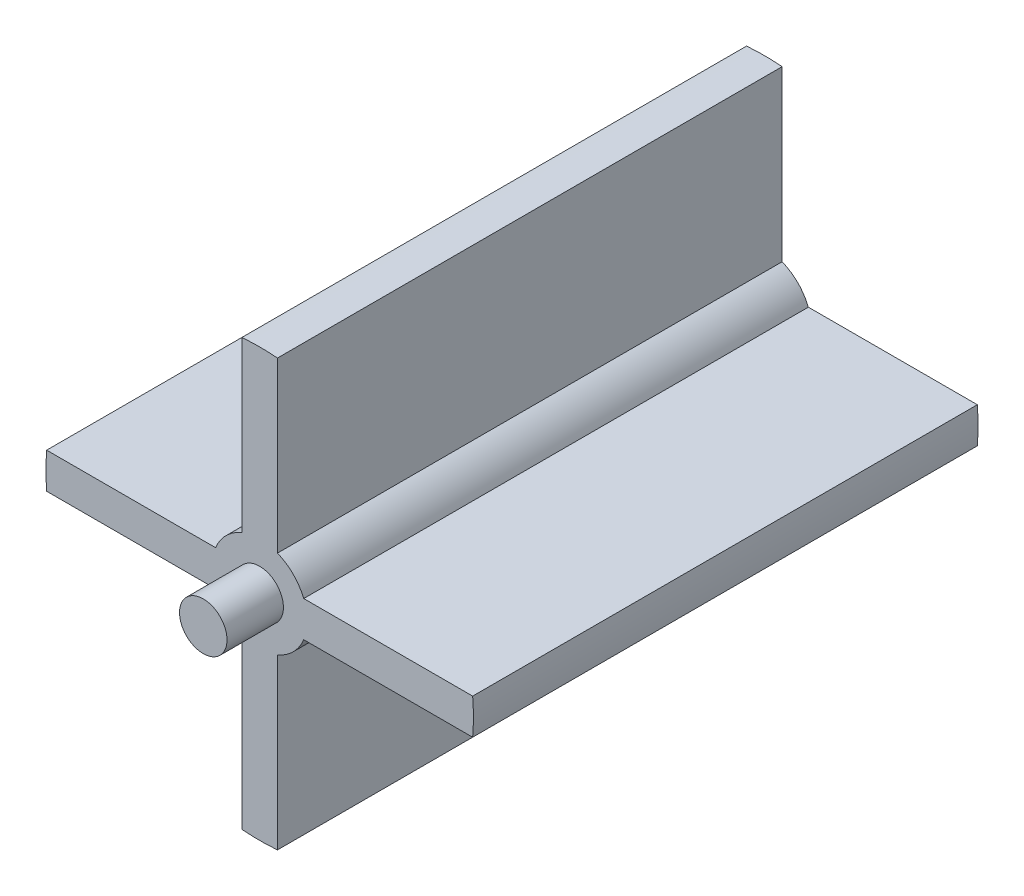
ISO-10303-21;
HEADER;
FILE_DESCRIPTION(('STEP AP214'),'2;1');
FILE_NAME('part.step','',(''),(''),'','','');
FILE_SCHEMA(('AUTOMOTIVE_DESIGN { 1 0 10303 214 1 1 1 1 }'));
ENDSEC;
DATA;
#1=APPLICATION_CONTEXT('core data for automotive mechanical design processes');
#2=APPLICATION_PROTOCOL_DEFINITION('international standard','automotive_design',2000,#1);
#3=PRODUCT_CONTEXT('',#1,'mechanical');
#4=PRODUCT('Part','Part','',(#3));
#5=PRODUCT_RELATED_PRODUCT_CATEGORY('part','',(#4));
#6=PRODUCT_DEFINITION_FORMATION('','',#4);
#7=PRODUCT_DEFINITION_CONTEXT('part definition',#1,'design');
#8=PRODUCT_DEFINITION('design','',#6,#7);
#9=PRODUCT_DEFINITION_SHAPE('','',#8);
#10=(LENGTH_UNIT() NAMED_UNIT(*) SI_UNIT(.MILLI.,.METRE.));
#11=(NAMED_UNIT(*) PLANE_ANGLE_UNIT() SI_UNIT($,.RADIAN.));
#12=(NAMED_UNIT(*) SI_UNIT($,.STERADIAN.) SOLID_ANGLE_UNIT());
#13=UNCERTAINTY_MEASURE_WITH_UNIT(LENGTH_MEASURE(1.E-05),#10,'distance_accuracy_value','');
#14=(GEOMETRIC_REPRESENTATION_CONTEXT(3) GLOBAL_UNCERTAINTY_ASSIGNED_CONTEXT((#13)) GLOBAL_UNIT_ASSIGNED_CONTEXT((#10,
#11,#12)) REPRESENTATION_CONTEXT('',''));
#15=CARTESIAN_POINT('',(0.,0.,0.));
#16=DIRECTION('',(0.,0.,1.));
#17=DIRECTION('',(1.,0.,0.));
#18=AXIS2_PLACEMENT_3D('',#15,#16,#17);
#19=CARTESIAN_POINT('',(9.53294491023637,-9.21867200110799,14.5));
#20=DIRECTION('',(0.,0.,-1.));
#21=DIRECTION('',(-1.,0.,0.));
#22=AXIS2_PLACEMENT_3D('',#19,#20,#21);
#23=CYLINDRICAL_SURFACE('',#22,3.975);
#24=CARTESIAN_POINT('',(9.53294491023637,-9.21867200110799,14.5));
#25=DIRECTION('',(0.,0.,1.));
#26=DIRECTION('',(1.,0.,0.));
#27=AXIS2_PLACEMENT_3D('',#24,#25,#26);
#28=CIRCLE('',#27,3.975);
#29=CARTESIAN_POINT('',(13.5079449102364,-9.21867200110799,14.5));
#30=VERTEX_POINT('',#29);
#31=EDGE_CURVE('E12',#30,#30,#28,.T.);
#32=ORIENTED_EDGE('',*,*,#31,.F.);
#33=EDGE_LOOP('',(#32));
#34=FACE_BOUND('',#33,.T.);
#35=CARTESIAN_POINT('',(9.53294491023637,-9.21867200110799,0.));
#36=DIRECTION('',(0.,0.,1.));
#37=DIRECTION('',(1.,0.,0.));
#38=AXIS2_PLACEMENT_3D('',#35,#36,#37);
#39=CIRCLE('',#38,3.975);
#40=CARTESIAN_POINT('',(13.5079449102364,-9.21867200110799,0.));
#41=VERTEX_POINT('',#40);
#42=EDGE_CURVE('E46',#41,#41,#39,.T.);
#43=ORIENTED_EDGE('',*,*,#42,.T.);
#44=EDGE_LOOP('',(#43));
#45=FACE_BOUND('',#44,.T.);
#46=ADVANCED_FACE('F43',(#34,#45),#23,.T.);
#47=CARTESIAN_POINT('',(9.53294491023637,-9.21867200110799,14.5));
#48=DIRECTION('',(0.,0.,1.));
#49=DIRECTION('',(1.,0.,0.));
#50=AXIS2_PLACEMENT_3D('',#47,#48,#49);
#51=PLANE('',#50);
#52=ORIENTED_EDGE('',*,*,#31,.T.);
#53=EDGE_LOOP('',(#52));
#54=FACE_BOUND('',#53,.T.);
#55=ADVANCED_FACE('F58',(#54),#51,.T.);
#56=CARTESIAN_POINT('',(9.53294491023637,-9.21867200110799,0.));
#57=DIRECTION('',(0.,0.,1.));
#58=DIRECTION('',(1.,0.,0.));
#59=AXIS2_PLACEMENT_3D('',#56,#57,#58);
#60=PLANE('',#59);
#61=ORIENTED_EDGE('',*,*,#42,.F.);
#62=EDGE_LOOP('',(#61));
#63=FACE_BOUND('',#62,.T.);
#64=ADVANCED_FACE('F56',(#63),#60,.F.);
#65=CLOSED_SHELL('',(#46,#55,#64));
#66=MANIFOLD_SOLID_BREP('B2',#65);
#67=CARTESIAN_POINT('',(-9.32342963748392,9.51199338296083,14.5));
#68=DIRECTION('',(0.,0.,-1.));
#69=DIRECTION('',(-1.,0.,0.));
#70=AXIS2_PLACEMENT_3D('',#67,#68,#69);
#71=CYLINDRICAL_SURFACE('',#70,3.975);
#72=CARTESIAN_POINT('',(-9.32342963748392,9.51199338296083,14.5));
#73=DIRECTION('',(0.,0.,1.));
#74=DIRECTION('',(1.,0.,0.));
#75=AXIS2_PLACEMENT_3D('',#72,#73,#74);
#76=CIRCLE('',#75,3.975);
#77=CARTESIAN_POINT('',(-5.34842963748392,9.51199338296083,14.5));
#78=VERTEX_POINT('',#77);
#79=EDGE_CURVE('E42',#78,#78,#76,.T.);
#80=ORIENTED_EDGE('',*,*,#79,.F.);
#81=EDGE_LOOP('',(#80));
#82=FACE_BOUND('',#81,.T.);
#83=CARTESIAN_POINT('',(-9.32342963748392,9.51199338296083,0.));
#84=DIRECTION('',(0.,0.,1.));
#85=DIRECTION('',(1.,0.,0.));
#86=AXIS2_PLACEMENT_3D('',#83,#84,#85);
#87=CIRCLE('',#86,3.975);
#88=CARTESIAN_POINT('',(-5.34842963748392,9.51199338296083,0.));
#89=VERTEX_POINT('',#88);
#90=EDGE_CURVE('E96',#89,#89,#87,.T.);
#91=ORIENTED_EDGE('',*,*,#90,.T.);
#92=EDGE_LOOP('',(#91));
#93=FACE_BOUND('',#92,.T.);
#94=ADVANCED_FACE('F93',(#82,#93),#71,.T.);
#95=CARTESIAN_POINT('',(-9.32342963748392,9.51199338296083,14.5));
#96=DIRECTION('',(0.,0.,1.));
#97=DIRECTION('',(1.,0.,0.));
#98=AXIS2_PLACEMENT_3D('',#95,#96,#97);
#99=PLANE('',#98);
#100=ORIENTED_EDGE('',*,*,#79,.T.);
#101=EDGE_LOOP('',(#100));
#102=FACE_BOUND('',#101,.T.);
#103=ADVANCED_FACE('F108',(#102),#99,.T.);
#104=CARTESIAN_POINT('',(-9.32342963748392,9.51199338296083,0.));
#105=DIRECTION('',(0.,0.,1.));
#106=DIRECTION('',(1.,0.,0.));
#107=AXIS2_PLACEMENT_3D('',#104,#105,#106);
#108=PLANE('',#107);
#109=ORIENTED_EDGE('',*,*,#90,.F.);
#110=EDGE_LOOP('',(#109));
#111=FACE_BOUND('',#110,.T.);
#112=ADVANCED_FACE('F106',(#111),#108,.F.);
#113=CLOSED_SHELL('',(#94,#103,#112));
#114=MANIFOLD_SOLID_BREP('B7',#113);
#115=CARTESIAN_POINT('',(0.,0.,85.));
#116=DIRECTION('',(0.,0.,-1.));
#117=DIRECTION('',(-1.,0.,0.));
#118=AXIS2_PLACEMENT_3D('',#115,#116,#117);
#119=CYLINDRICAL_SURFACE('',#118,36.);
#120=DIRECTION('',(0.,0.,-1.));
#121=VECTOR('',#120,1.);
#122=CARTESIAN_POINT('',(35.8747822293042,3.,85.));
#123=LINE('',#122,#121);
#124=CARTESIAN_POINT('',(35.8747822293042,3.,85.));
#125=VERTEX_POINT('',#124);
#126=CARTESIAN_POINT('',(35.8747822293042,3.,0.));
#127=VERTEX_POINT('',#126);
#128=EDGE_CURVE('E273',#125,#127,#123,.T.);
#129=ORIENTED_EDGE('',*,*,#128,.F.);
#130=CARTESIAN_POINT('',(0.,0.,85.));
#131=DIRECTION('',(0.,0.,1.));
#132=DIRECTION('',(1.,0.,0.));
#133=AXIS2_PLACEMENT_3D('',#130,#131,#132);
#134=CIRCLE('',#133,36.);
#135=CARTESIAN_POINT('',(35.8747822293042,-3.,85.));
#136=VERTEX_POINT('',#135);
#137=EDGE_CURVE('E143',#136,#125,#134,.T.);
#138=ORIENTED_EDGE('',*,*,#137,.F.);
#139=DIRECTION('',(0.,0.,-1.));
#140=VECTOR('',#139,1.);
#141=CARTESIAN_POINT('',(35.8747822293042,-3.,85.));
#142=LINE('',#141,#140);
#143=CARTESIAN_POINT('',(35.8747822293042,-3.,0.));
#144=VERTEX_POINT('',#143);
#145=EDGE_CURVE('E248',#136,#144,#142,.T.);
#146=ORIENTED_EDGE('',*,*,#145,.T.);
#147=CARTESIAN_POINT('',(0.,0.,0.));
#148=DIRECTION('',(0.,0.,1.));
#149=DIRECTION('',(1.,0.,0.));
#150=AXIS2_PLACEMENT_3D('',#147,#148,#149);
#151=CIRCLE('',#150,36.);
#152=EDGE_CURVE('E137',#144,#127,#151,.T.);
#153=ORIENTED_EDGE('',*,*,#152,.T.);
#154=EDGE_LOOP('',(#129,#138,#146,#153));
#155=FACE_BOUND('',#154,.T.);
#156=ADVANCED_FACE('F134',(#155),#119,.T.);
#157=DIRECTION('',(0.,0.,-1.));
#158=VECTOR('',#157,1.);
#159=CARTESIAN_POINT('',(3.,35.8747822293042,85.));
#160=LINE('',#159,#158);
#161=CARTESIAN_POINT('',(3.,35.8747822293042,85.));
#162=VERTEX_POINT('',#161);
#163=CARTESIAN_POINT('',(3.,35.8747822293042,0.));
#164=VERTEX_POINT('',#163);
#165=EDGE_CURVE('E310',#162,#164,#160,.T.);
#166=ORIENTED_EDGE('',*,*,#165,.T.);
#167=CARTESIAN_POINT('',(-2.99999999999999,35.8747822293042,0.));
#168=VERTEX_POINT('',#167);
#169=EDGE_CURVE('E275',#164,#168,#151,.T.);
#170=ORIENTED_EDGE('',*,*,#169,.T.);
#171=DIRECTION('',(0.,0.,-1.));
#172=VECTOR('',#171,1.);
#173=CARTESIAN_POINT('',(-2.99999999999999,35.8747822293042,85.));
#174=LINE('',#173,#172);
#175=CARTESIAN_POINT('',(-2.99999999999999,35.8747822293042,85.));
#176=VERTEX_POINT('',#175);
#177=EDGE_CURVE('E308',#176,#168,#174,.T.);
#178=ORIENTED_EDGE('',*,*,#177,.F.);
#179=EDGE_CURVE('E91',#162,#176,#134,.T.);
#180=ORIENTED_EDGE('',*,*,#179,.F.);
#181=EDGE_LOOP('',(#166,#170,#178,#180));
#182=FACE_BOUND('',#181,.T.);
#183=ADVANCED_FACE('F403',(#182),#119,.T.);
#184=DIRECTION('',(0.,0.,-1.));
#185=VECTOR('',#184,1.);
#186=CARTESIAN_POINT('',(-35.8747822293042,3.,85.));
#187=LINE('',#186,#185);
#188=CARTESIAN_POINT('',(-35.8747822293042,3.,85.));
#189=VERTEX_POINT('',#188);
#190=CARTESIAN_POINT('',(-35.8747822293042,3.,0.));
#191=VERTEX_POINT('',#190);
#192=EDGE_CURVE('E301',#189,#191,#187,.T.);
#193=ORIENTED_EDGE('',*,*,#192,.T.);
#194=CARTESIAN_POINT('',(-35.8747822293042,-2.99999999999999,0.));
#195=VERTEX_POINT('',#194);
#196=EDGE_CURVE('E278',#191,#195,#151,.T.);
#197=ORIENTED_EDGE('',*,*,#196,.T.);
#198=DIRECTION('',(0.,0.,-1.));
#199=VECTOR('',#198,1.);
#200=CARTESIAN_POINT('',(-35.8747822293042,-2.99999999999999,85.));
#201=LINE('',#200,#199);
#202=CARTESIAN_POINT('',(-35.8747822293042,-2.99999999999999,85.));
#203=VERTEX_POINT('',#202);
#204=EDGE_CURVE('E299',#203,#195,#201,.T.);
#205=ORIENTED_EDGE('',*,*,#204,.F.);
#206=EDGE_CURVE('E142',#189,#203,#134,.T.);
#207=ORIENTED_EDGE('',*,*,#206,.F.);
#208=EDGE_LOOP('',(#193,#197,#205,#207));
#209=FACE_BOUND('',#208,.T.);
#210=ADVANCED_FACE('F399',(#209),#119,.T.);
#211=DIRECTION('',(0.,0.,-1.));
#212=VECTOR('',#211,1.);
#213=CARTESIAN_POINT('',(-3.,-35.8747822293042,85.));
#214=LINE('',#213,#212);
#215=CARTESIAN_POINT('',(-3.,-35.8747822293042,85.));
#216=VERTEX_POINT('',#215);
#217=CARTESIAN_POINT('',(-3.,-35.8747822293042,0.));
#218=VERTEX_POINT('',#217);
#219=EDGE_CURVE('E291',#216,#218,#214,.T.);
#220=ORIENTED_EDGE('',*,*,#219,.T.);
#221=CARTESIAN_POINT('',(3.00000000000002,-35.8747822293042,0.));
#222=VERTEX_POINT('',#221);
#223=EDGE_CURVE('E428',#218,#222,#151,.T.);
#224=ORIENTED_EDGE('',*,*,#223,.T.);
#225=DIRECTION('',(0.,0.,-1.));
#226=VECTOR('',#225,1.);
#227=CARTESIAN_POINT('',(3.00000000000002,-35.8747822293042,85.));
#228=LINE('',#227,#226);
#229=CARTESIAN_POINT('',(3.00000000000002,-35.8747822293042,85.));
#230=VERTEX_POINT('',#229);
#231=EDGE_CURVE('E289',#230,#222,#228,.T.);
#232=ORIENTED_EDGE('',*,*,#231,.F.);
#233=EDGE_CURVE('E274',#216,#230,#134,.T.);
#234=ORIENTED_EDGE('',*,*,#233,.F.);
#235=EDGE_LOOP('',(#220,#224,#232,#234));
#236=FACE_BOUND('',#235,.T.);
#237=ADVANCED_FACE('F391',(#236),#119,.T.);
#238=CARTESIAN_POINT('',(0.,0.,85.));
#239=DIRECTION('',(0.,0.,1.));
#240=DIRECTION('',(1.,0.,0.));
#241=AXIS2_PLACEMENT_3D('',#238,#239,#240);
#242=PLANE('',#241);
#243=CARTESIAN_POINT('',(0.,0.,85.));
#244=DIRECTION('',(0.,0.,1.));
#245=DIRECTION('',(1.,0.,0.));
#246=AXIS2_PLACEMENT_3D('',#243,#244,#245);
#247=CIRCLE('',#246,4.);
#248=CARTESIAN_POINT('',(4.,0.,85.));
#249=VERTEX_POINT('',#248);
#250=EDGE_CURVE('E374',#249,#249,#247,.T.);
#251=ORIENTED_EDGE('',*,*,#250,.F.);
#252=EDGE_LOOP('',(#251));
#253=FACE_BOUND('',#252,.T.);
#254=ORIENTED_EDGE('',*,*,#137,.T.);
#255=DIRECTION('',(1.,0.,0.));
#256=VECTOR('',#255,1.);
#257=CARTESIAN_POINT('',(35.8747822293042,3.,85.));
#258=LINE('',#257,#256);
#259=CARTESIAN_POINT('',(7.41619848709566,3.,85.));
#260=VERTEX_POINT('',#259);
#261=EDGE_CURVE('E261',#260,#125,#258,.T.);
#262=ORIENTED_EDGE('',*,*,#261,.F.);
#263=CARTESIAN_POINT('',(0.,0.,85.));
#264=DIRECTION('',(0.,0.,-1.));
#265=DIRECTION('',(-1.,0.,0.));
#266=AXIS2_PLACEMENT_3D('',#263,#264,#265);
#267=CIRCLE('',#266,8.);
#268=CARTESIAN_POINT('',(3.,7.41619848709566,85.));
#269=VERTEX_POINT('',#268);
#270=EDGE_CURVE('E349',#269,#260,#267,.T.);
#271=ORIENTED_EDGE('',*,*,#270,.F.);
#272=DIRECTION('',(0.,-1.,0.));
#273=VECTOR('',#272,1.);
#274=CARTESIAN_POINT('',(3.,7.41619848709566,85.));
#275=LINE('',#274,#273);
#276=EDGE_CURVE('E352',#162,#269,#275,.T.);
#277=ORIENTED_EDGE('',*,*,#276,.F.);
#278=ORIENTED_EDGE('',*,*,#179,.T.);
#279=DIRECTION('',(0.,1.,0.));
#280=VECTOR('',#279,1.);
#281=CARTESIAN_POINT('',(-3.,35.8747822293042,85.));
#282=LINE('',#281,#280);
#283=CARTESIAN_POINT('',(-3.,7.41619848709566,85.));
#284=VERTEX_POINT('',#283);
#285=EDGE_CURVE('E355',#284,#176,#282,.T.);
#286=ORIENTED_EDGE('',*,*,#285,.F.);
#287=CARTESIAN_POINT('',(0.,0.,85.));
#288=DIRECTION('',(0.,0.,-1.));
#289=DIRECTION('',(-1.,0.,0.));
#290=AXIS2_PLACEMENT_3D('',#287,#288,#289);
#291=CIRCLE('',#290,8.);
#292=CARTESIAN_POINT('',(-7.41619848709566,3.,85.));
#293=VERTEX_POINT('',#292);
#294=EDGE_CURVE('E357',#293,#284,#291,.T.);
#295=ORIENTED_EDGE('',*,*,#294,.F.);
#296=DIRECTION('',(1.,0.,0.));
#297=VECTOR('',#296,1.);
#298=CARTESIAN_POINT('',(-7.41619848709566,3.,85.));
#299=LINE('',#298,#297);
#300=EDGE_CURVE('E360',#189,#293,#299,.T.);
#301=ORIENTED_EDGE('',*,*,#300,.F.);
#302=ORIENTED_EDGE('',*,*,#206,.T.);
#303=DIRECTION('',(-1.,0.,0.));
#304=VECTOR('',#303,1.);
#305=CARTESIAN_POINT('',(-35.8747822293042,-3.,85.));
#306=LINE('',#305,#304);
#307=CARTESIAN_POINT('',(-7.41619848709566,-3.,85.));
#308=VERTEX_POINT('',#307);
#309=EDGE_CURVE('E363',#308,#203,#306,.T.);
#310=ORIENTED_EDGE('',*,*,#309,.F.);
#311=CARTESIAN_POINT('',(0.,0.,85.));
#312=DIRECTION('',(0.,0.,-1.));
#313=DIRECTION('',(-1.,0.,0.));
#314=AXIS2_PLACEMENT_3D('',#311,#312,#313);
#315=CIRCLE('',#314,8.);
#316=CARTESIAN_POINT('',(-3.,-7.41619848709566,85.));
#317=VERTEX_POINT('',#316);
#318=EDGE_CURVE('E365',#317,#308,#315,.T.);
#319=ORIENTED_EDGE('',*,*,#318,.F.);
#320=DIRECTION('',(0.,1.,0.));
#321=VECTOR('',#320,1.);
#322=CARTESIAN_POINT('',(-3.,-35.8747822293042,85.));
#323=LINE('',#322,#321);
#324=EDGE_CURVE('E368',#216,#317,#323,.T.);
#325=ORIENTED_EDGE('',*,*,#324,.F.);
#326=ORIENTED_EDGE('',*,*,#233,.T.);
#327=DIRECTION('',(0.,-1.,0.));
#328=VECTOR('',#327,1.);
#329=CARTESIAN_POINT('',(3.,-7.41619848709566,85.));
#330=LINE('',#329,#328);
#331=CARTESIAN_POINT('',(3.,-7.41619848709566,85.));
#332=VERTEX_POINT('',#331);
#333=EDGE_CURVE('E371',#332,#230,#330,.T.);
#334=ORIENTED_EDGE('',*,*,#333,.F.);
#335=CARTESIAN_POINT('',(0.,0.,85.));
#336=DIRECTION('',(0.,0.,-1.));
#337=DIRECTION('',(-1.,0.,0.));
#338=AXIS2_PLACEMENT_3D('',#335,#336,#337);
#339=CIRCLE('',#338,8.);
#340=CARTESIAN_POINT('',(7.41619848709566,-3.,85.));
#341=VERTEX_POINT('',#340);
#342=EDGE_CURVE('E269',#341,#332,#339,.T.);
#343=ORIENTED_EDGE('',*,*,#342,.F.);
#344=DIRECTION('',(-1.,0.,0.));
#345=VECTOR('',#344,1.);
#346=CARTESIAN_POINT('',(7.41619848709566,-3.,85.));
#347=LINE('',#346,#345);
#348=EDGE_CURVE('E252',#136,#341,#347,.T.);
#349=ORIENTED_EDGE('',*,*,#348,.F.);
#350=EDGE_LOOP('',(#254,#262,#271,#277,#278,#286,#295,#301,#302,#310,#319,#325,#326,#334,#343,#349));
#351=FACE_BOUND('',#350,.T.);
#352=ADVANCED_FACE('F265',(#253,#351),#242,.T.);
#353=CARTESIAN_POINT('',(0.,0.,0.));
#354=DIRECTION('',(0.,0.,1.));
#355=DIRECTION('',(1.,0.,0.));
#356=AXIS2_PLACEMENT_3D('',#353,#354,#355);
#357=PLANE('',#356);
#358=CARTESIAN_POINT('',(0.,0.,0.));
#359=DIRECTION('',(0.,0.,-1.));
#360=DIRECTION('',(-1.,0.,0.));
#361=AXIS2_PLACEMENT_3D('',#358,#359,#360);
#362=CIRCLE('',#361,4.);
#363=CARTESIAN_POINT('',(-4.,0.,0.));
#364=VERTEX_POINT('',#363);
#365=EDGE_CURVE('E280',#364,#364,#362,.T.);
#366=ORIENTED_EDGE('',*,*,#365,.F.);
#367=EDGE_LOOP('',(#366));
#368=FACE_BOUND('',#367,.T.);
#369=DIRECTION('',(1.,0.,0.));
#370=VECTOR('',#369,1.);
#371=CARTESIAN_POINT('',(35.8747822293042,3.,0.));
#372=LINE('',#371,#370);
#373=CARTESIAN_POINT('',(7.41619848709566,3.,0.));
#374=VERTEX_POINT('',#373);
#375=EDGE_CURVE('E270',#374,#127,#372,.T.);
#376=ORIENTED_EDGE('',*,*,#375,.T.);
#377=ORIENTED_EDGE('',*,*,#152,.F.);
#378=DIRECTION('',(-1.,0.,0.));
#379=VECTOR('',#378,1.);
#380=CARTESIAN_POINT('',(7.41619848709566,-3.,0.));
#381=LINE('',#380,#379);
#382=CARTESIAN_POINT('',(7.41619848709566,-3.,0.));
#383=VERTEX_POINT('',#382);
#384=EDGE_CURVE('E255',#144,#383,#381,.T.);
#385=ORIENTED_EDGE('',*,*,#384,.T.);
#386=CARTESIAN_POINT('',(0.,0.,0.));
#387=DIRECTION('',(0.,0.,-1.));
#388=DIRECTION('',(-1.,0.,0.));
#389=AXIS2_PLACEMENT_3D('',#386,#387,#388);
#390=CIRCLE('',#389,8.);
#391=CARTESIAN_POINT('',(3.,-7.41619848709566,0.));
#392=VERTEX_POINT('',#391);
#393=EDGE_CURVE('E343',#383,#392,#390,.T.);
#394=ORIENTED_EDGE('',*,*,#393,.T.);
#395=DIRECTION('',(0.,-1.,0.));
#396=VECTOR('',#395,1.);
#397=CARTESIAN_POINT('',(3.,-7.41619848709566,0.));
#398=LINE('',#397,#396);
#399=EDGE_CURVE('E340',#392,#222,#398,.T.);
#400=ORIENTED_EDGE('',*,*,#399,.T.);
#401=ORIENTED_EDGE('',*,*,#223,.F.);
#402=DIRECTION('',(0.,1.,0.));
#403=VECTOR('',#402,1.);
#404=CARTESIAN_POINT('',(-3.,-35.8747822293042,0.));
#405=LINE('',#404,#403);
#406=CARTESIAN_POINT('',(-3.,-7.41619848709566,0.));
#407=VERTEX_POINT('',#406);
#408=EDGE_CURVE('E337',#218,#407,#405,.T.);
#409=ORIENTED_EDGE('',*,*,#408,.T.);
#410=CARTESIAN_POINT('',(0.,0.,0.));
#411=DIRECTION('',(0.,0.,-1.));
#412=DIRECTION('',(-1.,0.,0.));
#413=AXIS2_PLACEMENT_3D('',#410,#411,#412);
#414=CIRCLE('',#413,8.);
#415=CARTESIAN_POINT('',(-7.41619848709566,-3.,0.));
#416=VERTEX_POINT('',#415);
#417=EDGE_CURVE('E334',#407,#416,#414,.T.);
#418=ORIENTED_EDGE('',*,*,#417,.T.);
#419=DIRECTION('',(-1.,0.,0.));
#420=VECTOR('',#419,1.);
#421=CARTESIAN_POINT('',(-35.8747822293042,-3.,0.));
#422=LINE('',#421,#420);
#423=EDGE_CURVE('E331',#416,#195,#422,.T.);
#424=ORIENTED_EDGE('',*,*,#423,.T.);
#425=ORIENTED_EDGE('',*,*,#196,.F.);
#426=DIRECTION('',(1.,0.,0.));
#427=VECTOR('',#426,1.);
#428=CARTESIAN_POINT('',(-7.41619848709566,3.,0.));
#429=LINE('',#428,#427);
#430=CARTESIAN_POINT('',(-7.41619848709566,3.,0.));
#431=VERTEX_POINT('',#430);
#432=EDGE_CURVE('E328',#191,#431,#429,.T.);
#433=ORIENTED_EDGE('',*,*,#432,.T.);
#434=CARTESIAN_POINT('',(0.,0.,0.));
#435=DIRECTION('',(0.,0.,-1.));
#436=DIRECTION('',(-1.,0.,0.));
#437=AXIS2_PLACEMENT_3D('',#434,#435,#436);
#438=CIRCLE('',#437,8.);
#439=CARTESIAN_POINT('',(-3.,7.41619848709566,0.));
#440=VERTEX_POINT('',#439);
#441=EDGE_CURVE('E158',#431,#440,#438,.T.);
#442=ORIENTED_EDGE('',*,*,#441,.T.);
#443=DIRECTION('',(0.,1.,0.));
#444=VECTOR('',#443,1.);
#445=CARTESIAN_POINT('',(-3.,35.8747822293042,0.));
#446=LINE('',#445,#444);
#447=EDGE_CURVE('E324',#440,#168,#446,.T.);
#448=ORIENTED_EDGE('',*,*,#447,.T.);
#449=ORIENTED_EDGE('',*,*,#169,.F.);
#450=DIRECTION('',(0.,-1.,0.));
#451=VECTOR('',#450,1.);
#452=CARTESIAN_POINT('',(3.,7.41619848709566,0.));
#453=LINE('',#452,#451);
#454=CARTESIAN_POINT('',(3.,7.41619848709566,0.));
#455=VERTEX_POINT('',#454);
#456=EDGE_CURVE('E321',#164,#455,#453,.T.);
#457=ORIENTED_EDGE('',*,*,#456,.T.);
#458=CARTESIAN_POINT('',(0.,0.,0.));
#459=DIRECTION('',(0.,0.,-1.));
#460=DIRECTION('',(-1.,0.,0.));
#461=AXIS2_PLACEMENT_3D('',#458,#459,#460);
#462=CIRCLE('',#461,8.);
#463=EDGE_CURVE('E150',#455,#374,#462,.T.);
#464=ORIENTED_EDGE('',*,*,#463,.T.);
#465=EDGE_LOOP('',(#376,#377,#385,#394,#400,#401,#409,#418,#424,#425,#433,#442,#448,#449,#457,#464));
#466=FACE_BOUND('',#465,.T.);
#467=ADVANCED_FACE('F390',(#368,#466),#357,.F.);
#468=CARTESIAN_POINT('',(0.,0.,5.));
#469=DIRECTION('',(0.,0.,-1.));
#470=DIRECTION('',(-1.,0.,0.));
#471=AXIS2_PLACEMENT_3D('',#468,#469,#470);
#472=CYLINDRICAL_SURFACE('',#471,4.);
#473=CARTESIAN_POINT('',(0.,0.,5.));
#474=DIRECTION('',(0.,0.,-1.));
#475=DIRECTION('',(-1.,0.,0.));
#476=AXIS2_PLACEMENT_3D('',#473,#474,#475);
#477=CIRCLE('',#476,4.);
#478=CARTESIAN_POINT('',(-4.,0.,5.));
#479=VERTEX_POINT('',#478);
#480=EDGE_CURVE('E283',#479,#479,#477,.T.);
#481=ORIENTED_EDGE('',*,*,#480,.F.);
#482=EDGE_LOOP('',(#481));
#483=FACE_BOUND('',#482,.T.);
#484=ORIENTED_EDGE('',*,*,#365,.T.);
#485=EDGE_LOOP('',(#484));
#486=FACE_BOUND('',#485,.T.);
#487=ADVANCED_FACE('F397',(#483,#486),#472,.F.);
#488=CARTESIAN_POINT('',(0.,0.,5.));
#489=DIRECTION('',(0.,0.,-1.));
#490=DIRECTION('',(-1.,0.,0.));
#491=AXIS2_PLACEMENT_3D('',#488,#489,#490);
#492=PLANE('',#491);
#493=ORIENTED_EDGE('',*,*,#480,.T.);
#494=EDGE_LOOP('',(#493));
#495=FACE_BOUND('',#494,.T.);
#496=ADVANCED_FACE('F477',(#495),#492,.T.);
#497=CARTESIAN_POINT('',(7.41619848709566,-3.,85.));
#498=DIRECTION('',(0.,-1.,0.));
#499=DIRECTION('',(1.,0.,0.));
#500=AXIS2_PLACEMENT_3D('',#497,#498,#499);
#501=PLANE('',#500);
#502=ORIENTED_EDGE('',*,*,#384,.F.);
#503=ORIENTED_EDGE('',*,*,#145,.F.);
#504=ORIENTED_EDGE('',*,*,#348,.T.);
#505=DIRECTION('',(0.,0.,-1.));
#506=VECTOR('',#505,1.);
#507=CARTESIAN_POINT('',(7.41619848709566,-3.,85.));
#508=LINE('',#507,#506);
#509=EDGE_CURVE('E260',#341,#383,#508,.T.);
#510=ORIENTED_EDGE('',*,*,#509,.T.);
#511=EDGE_LOOP('',(#502,#503,#504,#510));
#512=FACE_BOUND('',#511,.T.);
#513=ADVANCED_FACE('F250',(#512),#501,.T.);
#514=CARTESIAN_POINT('',(0.,0.,85.));
#515=DIRECTION('',(0.,0.,-1.));
#516=DIRECTION('',(-1.,0.,0.));
#517=AXIS2_PLACEMENT_3D('',#514,#515,#516);
#518=CYLINDRICAL_SURFACE('',#517,8.);
#519=ORIENTED_EDGE('',*,*,#393,.F.);
#520=ORIENTED_EDGE('',*,*,#509,.F.);
#521=ORIENTED_EDGE('',*,*,#342,.T.);
#522=DIRECTION('',(0.,0.,-1.));
#523=VECTOR('',#522,1.);
#524=CARTESIAN_POINT('',(3.,-7.41619848709566,85.));
#525=LINE('',#524,#523);
#526=EDGE_CURVE('E287',#332,#392,#525,.T.);
#527=ORIENTED_EDGE('',*,*,#526,.T.);
#528=EDGE_LOOP('',(#519,#520,#521,#527));
#529=FACE_BOUND('',#528,.T.);
#530=ADVANCED_FACE('F470',(#529),#518,.T.);
#531=CARTESIAN_POINT('',(3.,-7.41619848709566,85.));
#532=DIRECTION('',(1.,0.,0.));
#533=DIRECTION('',(0.,1.,0.));
#534=AXIS2_PLACEMENT_3D('',#531,#532,#533);
#535=PLANE('',#534);
#536=ORIENTED_EDGE('',*,*,#399,.F.);
#537=ORIENTED_EDGE('',*,*,#526,.F.);
#538=ORIENTED_EDGE('',*,*,#333,.T.);
#539=ORIENTED_EDGE('',*,*,#231,.T.);
#540=EDGE_LOOP('',(#536,#537,#538,#539));
#541=FACE_BOUND('',#540,.T.);
#542=ADVANCED_FACE('F466',(#541),#535,.T.);
#543=CARTESIAN_POINT('',(-3.,-35.8747822293042,85.));
#544=DIRECTION('',(-1.,0.,0.));
#545=DIRECTION('',(0.,0.,1.));
#546=AXIS2_PLACEMENT_3D('',#543,#544,#545);
#547=PLANE('',#546);
#548=ORIENTED_EDGE('',*,*,#408,.F.);
#549=ORIENTED_EDGE('',*,*,#219,.F.);
#550=ORIENTED_EDGE('',*,*,#324,.T.);
#551=DIRECTION('',(0.,0.,-1.));
#552=VECTOR('',#551,1.);
#553=CARTESIAN_POINT('',(-3.,-7.41619848709566,85.));
#554=LINE('',#553,#552);
#555=EDGE_CURVE('E294',#317,#407,#554,.T.);
#556=ORIENTED_EDGE('',*,*,#555,.T.);
#557=EDGE_LOOP('',(#548,#549,#550,#556));
#558=FACE_BOUND('',#557,.T.);
#559=ADVANCED_FACE('F462',(#558),#547,.T.);
#560=CARTESIAN_POINT('',(0.,0.,85.));
#561=DIRECTION('',(0.,0.,-1.));
#562=DIRECTION('',(-1.,0.,0.));
#563=AXIS2_PLACEMENT_3D('',#560,#561,#562);
#564=CYLINDRICAL_SURFACE('',#563,8.);
#565=ORIENTED_EDGE('',*,*,#417,.F.);
#566=ORIENTED_EDGE('',*,*,#555,.F.);
#567=ORIENTED_EDGE('',*,*,#318,.T.);
#568=DIRECTION('',(0.,0.,-1.));
#569=VECTOR('',#568,1.);
#570=CARTESIAN_POINT('',(-7.41619848709566,-3.,85.));
#571=LINE('',#570,#569);
#572=EDGE_CURVE('E297',#308,#416,#571,.T.);
#573=ORIENTED_EDGE('',*,*,#572,.T.);
#574=EDGE_LOOP('',(#565,#566,#567,#573));
#575=FACE_BOUND('',#574,.T.);
#576=ADVANCED_FACE('F459',(#575),#564,.T.);
#577=CARTESIAN_POINT('',(-35.8747822293042,-3.,85.));
#578=DIRECTION('',(0.,-1.,0.));
#579=DIRECTION('',(1.,0.,0.));
#580=AXIS2_PLACEMENT_3D('',#577,#578,#579);
#581=PLANE('',#580);
#582=ORIENTED_EDGE('',*,*,#423,.F.);
#583=ORIENTED_EDGE('',*,*,#572,.F.);
#584=ORIENTED_EDGE('',*,*,#309,.T.);
#585=ORIENTED_EDGE('',*,*,#204,.T.);
#586=EDGE_LOOP('',(#582,#583,#584,#585));
#587=FACE_BOUND('',#586,.T.);
#588=ADVANCED_FACE('F439',(#587),#581,.T.);
#589=CARTESIAN_POINT('',(-7.41619848709566,3.,85.));
#590=DIRECTION('',(0.,1.,0.));
#591=DIRECTION('',(0.,0.,1.));
#592=AXIS2_PLACEMENT_3D('',#589,#590,#591);
#593=PLANE('',#592);
#594=ORIENTED_EDGE('',*,*,#432,.F.);
#595=ORIENTED_EDGE('',*,*,#192,.F.);
#596=ORIENTED_EDGE('',*,*,#300,.T.);
#597=DIRECTION('',(0.,0.,-1.));
#598=VECTOR('',#597,1.);
#599=CARTESIAN_POINT('',(-7.41619848709566,3.,85.));
#600=LINE('',#599,#598);
#601=EDGE_CURVE('E304',#293,#431,#600,.T.);
#602=ORIENTED_EDGE('',*,*,#601,.T.);
#603=EDGE_LOOP('',(#594,#595,#596,#602));
#604=FACE_BOUND('',#603,.T.);
#605=ADVANCED_FACE('F445',(#604),#593,.T.);
#606=CARTESIAN_POINT('',(0.,0.,85.));
#607=DIRECTION('',(0.,0.,-1.));
#608=DIRECTION('',(-1.,0.,0.));
#609=AXIS2_PLACEMENT_3D('',#606,#607,#608);
#610=CYLINDRICAL_SURFACE('',#609,8.);
#611=ORIENTED_EDGE('',*,*,#441,.F.);
#612=ORIENTED_EDGE('',*,*,#601,.F.);
#613=ORIENTED_EDGE('',*,*,#294,.T.);
#614=DIRECTION('',(0.,0.,-1.));
#615=VECTOR('',#614,1.);
#616=CARTESIAN_POINT('',(-3.,7.41619848709566,85.));
#617=LINE('',#616,#615);
#618=EDGE_CURVE('E306',#284,#440,#617,.T.);
#619=ORIENTED_EDGE('',*,*,#618,.T.);
#620=EDGE_LOOP('',(#611,#612,#613,#619));
#621=FACE_BOUND('',#620,.T.);
#622=ADVANCED_FACE('F446',(#621),#610,.T.);
#623=CARTESIAN_POINT('',(-3.,35.8747822293042,85.));
#624=DIRECTION('',(-1.,0.,0.));
#625=DIRECTION('',(0.,-1.,0.));
#626=AXIS2_PLACEMENT_3D('',#623,#624,#625);
#627=PLANE('',#626);
#628=ORIENTED_EDGE('',*,*,#447,.F.);
#629=ORIENTED_EDGE('',*,*,#618,.F.);
#630=ORIENTED_EDGE('',*,*,#285,.T.);
#631=ORIENTED_EDGE('',*,*,#177,.T.);
#632=EDGE_LOOP('',(#628,#629,#630,#631));
#633=FACE_BOUND('',#632,.T.);
#634=ADVANCED_FACE('F420',(#633),#627,.T.);
#635=CARTESIAN_POINT('',(35.8747822293042,3.,85.));
#636=DIRECTION('',(0.,1.,0.));
#637=DIRECTION('',(0.,0.,1.));
#638=AXIS2_PLACEMENT_3D('',#635,#636,#637);
#639=PLANE('',#638);
#640=ORIENTED_EDGE('',*,*,#375,.F.);
#641=DIRECTION('',(0.,0.,-1.));
#642=VECTOR('',#641,1.);
#643=CARTESIAN_POINT('',(7.41619848709566,3.,85.));
#644=LINE('',#643,#642);
#645=EDGE_CURVE('E315',#260,#374,#644,.T.);
#646=ORIENTED_EDGE('',*,*,#645,.F.);
#647=ORIENTED_EDGE('',*,*,#261,.T.);
#648=ORIENTED_EDGE('',*,*,#128,.T.);
#649=EDGE_LOOP('',(#640,#646,#647,#648));
#650=FACE_BOUND('',#649,.T.);
#651=ADVANCED_FACE('F427',(#650),#639,.T.);
#652=CARTESIAN_POINT('',(0.,0.,85.));
#653=DIRECTION('',(0.,0.,-1.));
#654=DIRECTION('',(-1.,0.,0.));
#655=AXIS2_PLACEMENT_3D('',#652,#653,#654);
#656=CYLINDRICAL_SURFACE('',#655,8.);
#657=ORIENTED_EDGE('',*,*,#463,.F.);
#658=DIRECTION('',(0.,0.,-1.));
#659=VECTOR('',#658,1.);
#660=CARTESIAN_POINT('',(3.,7.41619848709566,85.));
#661=LINE('',#660,#659);
#662=EDGE_CURVE('E313',#269,#455,#661,.T.);
#663=ORIENTED_EDGE('',*,*,#662,.F.);
#664=ORIENTED_EDGE('',*,*,#270,.T.);
#665=ORIENTED_EDGE('',*,*,#645,.T.);
#666=EDGE_LOOP('',(#657,#663,#664,#665));
#667=FACE_BOUND('',#666,.T.);
#668=ADVANCED_FACE('F424',(#667),#656,.T.);
#669=CARTESIAN_POINT('',(3.,7.41619848709566,85.));
#670=DIRECTION('',(1.,0.,0.));
#671=DIRECTION('',(0.,0.,-1.));
#672=AXIS2_PLACEMENT_3D('',#669,#670,#671);
#673=PLANE('',#672);
#674=ORIENTED_EDGE('',*,*,#456,.F.);
#675=ORIENTED_EDGE('',*,*,#165,.F.);
#676=ORIENTED_EDGE('',*,*,#276,.T.);
#677=ORIENTED_EDGE('',*,*,#662,.T.);
#678=EDGE_LOOP('',(#674,#675,#676,#677));
#679=FACE_BOUND('',#678,.T.);
#680=ADVANCED_FACE('F385',(#679),#673,.T.);
#681=CARTESIAN_POINT('',(0.,0.,94.5));
#682=DIRECTION('',(0.,0.,-1.));
#683=DIRECTION('',(-1.,0.,0.));
#684=AXIS2_PLACEMENT_3D('',#681,#682,#683);
#685=CYLINDRICAL_SURFACE('',#684,4.);
#686=CARTESIAN_POINT('',(0.,0.,94.5));
#687=DIRECTION('',(0.,0.,1.));
#688=DIRECTION('',(1.,0.,0.));
#689=AXIS2_PLACEMENT_3D('',#686,#687,#688);
#690=CIRCLE('',#689,4.);
#691=CARTESIAN_POINT('',(4.,0.,94.5));
#692=VERTEX_POINT('',#691);
#693=EDGE_CURVE('E347',#692,#692,#690,.T.);
#694=ORIENTED_EDGE('',*,*,#693,.F.);
#695=EDGE_LOOP('',(#694));
#696=FACE_BOUND('',#695,.T.);
#697=ORIENTED_EDGE('',*,*,#250,.T.);
#698=EDGE_LOOP('',(#697));
#699=FACE_BOUND('',#698,.T.);
#700=ADVANCED_FACE('F382',(#696,#699),#685,.T.);
#701=CARTESIAN_POINT('',(0.,0.,94.5));
#702=DIRECTION('',(0.,0.,1.));
#703=DIRECTION('',(1.,0.,0.));
#704=AXIS2_PLACEMENT_3D('',#701,#702,#703);
#705=PLANE('',#704);
#706=ORIENTED_EDGE('',*,*,#693,.T.);
#707=EDGE_LOOP('',(#706));
#708=FACE_BOUND('',#707,.T.);
#709=ADVANCED_FACE('F380',(#708),#705,.T.);
#710=CLOSED_SHELL('',(#156,#183,#210,#237,#352,#467,#487,#496,#513,#530,#542,#559,#576,#588,
#605,#622,#634,#651,#668,#680,#700,#709));
#711=MANIFOLD_SOLID_BREP('B37',#710);
#712=ADVANCED_BREP_SHAPE_REPRESENTATION('',(#18,#66,#114,#711),#14);
#713=SHAPE_DEFINITION_REPRESENTATION(#9,#712);
ENDSEC;
END-ISO-10303-21;
